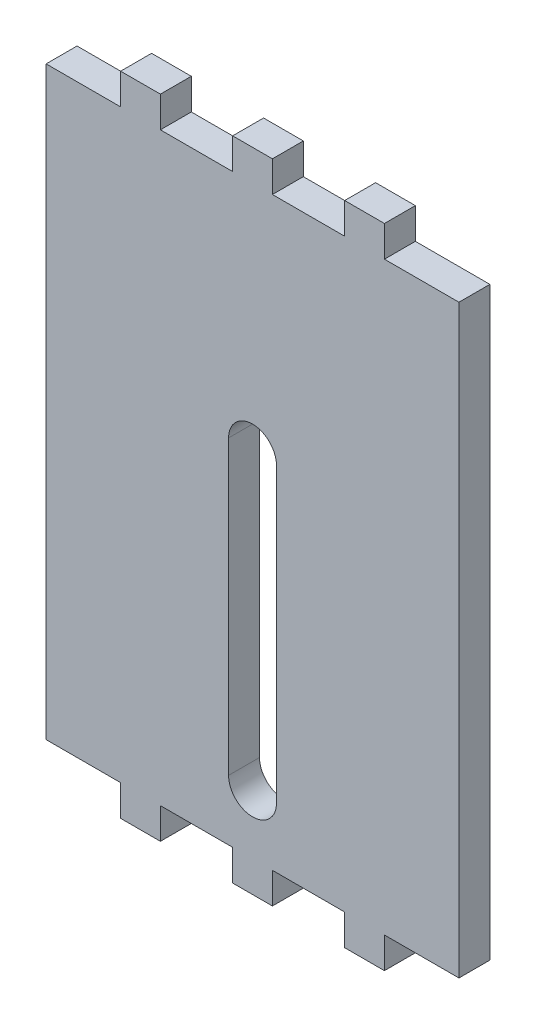
ISO-10303-21;
HEADER;
FILE_DESCRIPTION(('STEP AP214'),'2;1');
FILE_NAME('part.step','',(''),(''),'','','');
FILE_SCHEMA(('AUTOMOTIVE_DESIGN { 1 0 10303 214 1 1 1 1 }'));
ENDSEC;
DATA;
#1=APPLICATION_CONTEXT('core data for automotive mechanical design processes');
#2=APPLICATION_PROTOCOL_DEFINITION('international standard','automotive_design',2000,#1);
#3=PRODUCT_CONTEXT('',#1,'mechanical');
#4=PRODUCT('Part','Part','',(#3));
#5=PRODUCT_RELATED_PRODUCT_CATEGORY('part','',(#4));
#6=PRODUCT_DEFINITION_FORMATION('','',#4);
#7=PRODUCT_DEFINITION_CONTEXT('part definition',#1,'design');
#8=PRODUCT_DEFINITION('design','',#6,#7);
#9=PRODUCT_DEFINITION_SHAPE('','',#8);
#10=(LENGTH_UNIT() NAMED_UNIT(*) SI_UNIT(.MILLI.,.METRE.));
#11=(NAMED_UNIT(*) PLANE_ANGLE_UNIT() SI_UNIT($,.RADIAN.));
#12=(NAMED_UNIT(*) SI_UNIT($,.STERADIAN.) SOLID_ANGLE_UNIT());
#13=UNCERTAINTY_MEASURE_WITH_UNIT(LENGTH_MEASURE(1.E-05),#10,'distance_accuracy_value','');
#14=(GEOMETRIC_REPRESENTATION_CONTEXT(3) GLOBAL_UNCERTAINTY_ASSIGNED_CONTEXT((#13)) GLOBAL_UNIT_ASSIGNED_CONTEXT((#10,
#11,#12)) REPRESENTATION_CONTEXT('',''));
#15=CARTESIAN_POINT('',(0.,0.,0.));
#16=DIRECTION('',(0.,0.,1.));
#17=DIRECTION('',(1.,0.,0.));
#18=AXIS2_PLACEMENT_3D('',#15,#16,#17);
#19=CARTESIAN_POINT('',(13.54064,-21.19064,0.));
#20=DIRECTION('',(0.,-1.,0.));
#21=DIRECTION('',(0.,0.,-1.));
#22=AXIS2_PLACEMENT_3D('',#19,#20,#21);
#23=PLANE('',#22);
#24=DIRECTION('',(1.,0.,0.));
#25=VECTOR('',#24,1.);
#26=CARTESIAN_POINT('',(13.54064,-21.19064,3.175));
#27=LINE('',#26,#25);
#28=CARTESIAN_POINT('',(13.54064,-21.19064,3.175));
#29=VERTEX_POINT('',#28);
#30=CARTESIAN_POINT('',(21.19064,-21.19064,3.175));
#31=VERTEX_POINT('',#30);
#32=EDGE_CURVE('E294',#29,#31,#27,.T.);
#33=ORIENTED_EDGE('',*,*,#32,.F.);
#34=DIRECTION('',(0.,0.,1.));
#35=VECTOR('',#34,1.);
#36=CARTESIAN_POINT('',(13.54064,-21.19064,0.));
#37=LINE('',#36,#35);
#38=CARTESIAN_POINT('',(13.54064,-21.19064,0.));
#39=VERTEX_POINT('',#38);
#40=EDGE_CURVE('E11',#39,#29,#37,.T.);
#41=ORIENTED_EDGE('',*,*,#40,.F.);
#42=DIRECTION('',(1.,0.,0.));
#43=VECTOR('',#42,1.);
#44=CARTESIAN_POINT('',(13.54064,-21.19064,0.));
#45=LINE('',#44,#43);
#46=CARTESIAN_POINT('',(21.19064,-21.19064,0.));
#47=VERTEX_POINT('',#46);
#48=EDGE_CURVE('E300',#39,#47,#45,.T.);
#49=ORIENTED_EDGE('',*,*,#48,.T.);
#50=DIRECTION('',(0.,0.,1.));
#51=VECTOR('',#50,1.);
#52=CARTESIAN_POINT('',(21.19064,-21.19064,0.));
#53=LINE('',#52,#51);
#54=EDGE_CURVE('E45',#47,#31,#53,.T.);
#55=ORIENTED_EDGE('',*,*,#54,.T.);
#56=EDGE_LOOP('',(#33,#41,#49,#55));
#57=FACE_BOUND('',#56,.T.);
#58=ADVANCED_FACE('F41',(#57),#23,.T.);
#59=CARTESIAN_POINT('',(13.54064,-24.36564,0.));
#60=DIRECTION('',(1.,0.,0.));
#61=DIRECTION('',(0.,0.,-1.));
#62=AXIS2_PLACEMENT_3D('',#59,#60,#61);
#63=PLANE('',#62);
#64=DIRECTION('',(0.,1.,0.));
#65=VECTOR('',#64,1.);
#66=CARTESIAN_POINT('',(13.54064,-24.36564,3.175));
#67=LINE('',#66,#65);
#68=CARTESIAN_POINT('',(13.54064,-24.36564,3.175));
#69=VERTEX_POINT('',#68);
#70=EDGE_CURVE('E305',#69,#29,#67,.T.);
#71=ORIENTED_EDGE('',*,*,#70,.F.);
#72=DIRECTION('',(0.,0.,1.));
#73=VECTOR('',#72,1.);
#74=CARTESIAN_POINT('',(13.54064,-24.36564,0.));
#75=LINE('',#74,#73);
#76=CARTESIAN_POINT('',(13.54064,-24.36564,0.));
#77=VERTEX_POINT('',#76);
#78=EDGE_CURVE('E51',#77,#69,#75,.T.);
#79=ORIENTED_EDGE('',*,*,#78,.F.);
#80=DIRECTION('',(0.,1.,0.));
#81=VECTOR('',#80,1.);
#82=CARTESIAN_POINT('',(13.54064,-24.36564,0.));
#83=LINE('',#82,#81);
#84=EDGE_CURVE('E409',#77,#39,#83,.T.);
#85=ORIENTED_EDGE('',*,*,#84,.T.);
#86=ORIENTED_EDGE('',*,*,#40,.T.);
#87=EDGE_LOOP('',(#71,#79,#85,#86));
#88=FACE_BOUND('',#87,.T.);
#89=ADVANCED_FACE('F612',(#88),#63,.T.);
#90=CARTESIAN_POINT('',(9.45935999999996,-24.36564,0.));
#91=DIRECTION('',(0.,-1.,0.));
#92=DIRECTION('',(0.,0.,-1.));
#93=AXIS2_PLACEMENT_3D('',#90,#91,#92);
#94=PLANE('',#93);
#95=DIRECTION('',(1.,0.,0.));
#96=VECTOR('',#95,1.);
#97=CARTESIAN_POINT('',(9.45935999999996,-24.36564,3.175));
#98=LINE('',#97,#96);
#99=CARTESIAN_POINT('',(9.45935999999996,-24.36564,3.175));
#100=VERTEX_POINT('',#99);
#101=EDGE_CURVE('E516',#100,#69,#98,.T.);
#102=ORIENTED_EDGE('',*,*,#101,.F.);
#103=DIRECTION('',(0.,0.,1.));
#104=VECTOR('',#103,1.);
#105=CARTESIAN_POINT('',(9.45935999999996,-24.36564,0.));
#106=LINE('',#105,#104);
#107=CARTESIAN_POINT('',(9.45935999999996,-24.36564,0.));
#108=VERTEX_POINT('',#107);
#109=EDGE_CURVE('E525',#108,#100,#106,.T.);
#110=ORIENTED_EDGE('',*,*,#109,.F.);
#111=DIRECTION('',(1.,0.,0.));
#112=VECTOR('',#111,1.);
#113=CARTESIAN_POINT('',(9.45935999999996,-24.36564,0.));
#114=LINE('',#113,#112);
#115=EDGE_CURVE('E405',#108,#77,#114,.T.);
#116=ORIENTED_EDGE('',*,*,#115,.T.);
#117=ORIENTED_EDGE('',*,*,#78,.T.);
#118=EDGE_LOOP('',(#102,#110,#116,#117));
#119=FACE_BOUND('',#118,.T.);
#120=ADVANCED_FACE('F711',(#119),#94,.T.);
#121=CARTESIAN_POINT('',(9.45935999999996,-21.19064,0.));
#122=DIRECTION('',(-1.,0.,0.));
#123=DIRECTION('',(0.,0.,1.));
#124=AXIS2_PLACEMENT_3D('',#121,#122,#123);
#125=PLANE('',#124);
#126=DIRECTION('',(0.,-1.,0.));
#127=VECTOR('',#126,1.);
#128=CARTESIAN_POINT('',(9.45935999999996,-21.19064,3.175));
#129=LINE('',#128,#127);
#130=CARTESIAN_POINT('',(9.45935999999996,-21.19064,3.175));
#131=VERTEX_POINT('',#130);
#132=EDGE_CURVE('E512',#131,#100,#129,.T.);
#133=ORIENTED_EDGE('',*,*,#132,.F.);
#134=DIRECTION('',(0.,0.,1.));
#135=VECTOR('',#134,1.);
#136=CARTESIAN_POINT('',(9.45935999999996,-21.19064,0.));
#137=LINE('',#136,#135);
#138=CARTESIAN_POINT('',(9.45935999999996,-21.19064,0.));
#139=VERTEX_POINT('',#138);
#140=EDGE_CURVE('E528',#139,#131,#137,.T.);
#141=ORIENTED_EDGE('',*,*,#140,.F.);
#142=DIRECTION('',(0.,-1.,0.));
#143=VECTOR('',#142,1.);
#144=CARTESIAN_POINT('',(9.45935999999996,-21.19064,0.));
#145=LINE('',#144,#143);
#146=EDGE_CURVE('E401',#139,#108,#145,.T.);
#147=ORIENTED_EDGE('',*,*,#146,.T.);
#148=ORIENTED_EDGE('',*,*,#109,.T.);
#149=EDGE_LOOP('',(#133,#141,#147,#148));
#150=FACE_BOUND('',#149,.T.);
#151=ADVANCED_FACE('F709',(#150),#125,.T.);
#152=CARTESIAN_POINT('',(2.04063999999996,-21.19064,0.));
#153=DIRECTION('',(0.,-1.,0.));
#154=DIRECTION('',(0.,0.,-1.));
#155=AXIS2_PLACEMENT_3D('',#152,#153,#154);
#156=PLANE('',#155);
#157=DIRECTION('',(1.,0.,0.));
#158=VECTOR('',#157,1.);
#159=CARTESIAN_POINT('',(2.04063999999996,-21.19064,3.175));
#160=LINE('',#159,#158);
#161=CARTESIAN_POINT('',(2.04063999999996,-21.19064,3.175));
#162=VERTEX_POINT('',#161);
#163=EDGE_CURVE('E508',#162,#131,#160,.T.);
#164=ORIENTED_EDGE('',*,*,#163,.F.);
#165=DIRECTION('',(0.,0.,1.));
#166=VECTOR('',#165,1.);
#167=CARTESIAN_POINT('',(2.04063999999996,-21.19064,0.));
#168=LINE('',#167,#166);
#169=CARTESIAN_POINT('',(2.04063999999996,-21.19064,0.));
#170=VERTEX_POINT('',#169);
#171=EDGE_CURVE('E531',#170,#162,#168,.T.);
#172=ORIENTED_EDGE('',*,*,#171,.F.);
#173=DIRECTION('',(1.,0.,0.));
#174=VECTOR('',#173,1.);
#175=CARTESIAN_POINT('',(2.04063999999996,-21.19064,0.));
#176=LINE('',#175,#174);
#177=EDGE_CURVE('E397',#170,#139,#176,.T.);
#178=ORIENTED_EDGE('',*,*,#177,.T.);
#179=ORIENTED_EDGE('',*,*,#140,.T.);
#180=EDGE_LOOP('',(#164,#172,#178,#179));
#181=FACE_BOUND('',#180,.T.);
#182=ADVANCED_FACE('F705',(#181),#156,.T.);
#183=CARTESIAN_POINT('',(2.04063999999996,-24.36564,0.));
#184=DIRECTION('',(1.,0.,0.));
#185=DIRECTION('',(0.,1.,0.));
#186=AXIS2_PLACEMENT_3D('',#183,#184,#185);
#187=PLANE('',#186);
#188=DIRECTION('',(0.,1.,0.));
#189=VECTOR('',#188,1.);
#190=CARTESIAN_POINT('',(2.04063999999996,-24.36564,3.175));
#191=LINE('',#190,#189);
#192=CARTESIAN_POINT('',(2.04063999999996,-24.36564,3.175));
#193=VERTEX_POINT('',#192);
#194=EDGE_CURVE('E504',#193,#162,#191,.T.);
#195=ORIENTED_EDGE('',*,*,#194,.F.);
#196=DIRECTION('',(0.,0.,1.));
#197=VECTOR('',#196,1.);
#198=CARTESIAN_POINT('',(2.04063999999996,-24.36564,0.));
#199=LINE('',#198,#197);
#200=CARTESIAN_POINT('',(2.04063999999996,-24.36564,0.));
#201=VERTEX_POINT('',#200);
#202=EDGE_CURVE('E534',#201,#193,#199,.T.);
#203=ORIENTED_EDGE('',*,*,#202,.F.);
#204=DIRECTION('',(0.,1.,0.));
#205=VECTOR('',#204,1.);
#206=CARTESIAN_POINT('',(2.04063999999996,-24.36564,0.));
#207=LINE('',#206,#205);
#208=EDGE_CURVE('E393',#201,#170,#207,.T.);
#209=ORIENTED_EDGE('',*,*,#208,.T.);
#210=ORIENTED_EDGE('',*,*,#171,.T.);
#211=EDGE_LOOP('',(#195,#203,#209,#210));
#212=FACE_BOUND('',#211,.T.);
#213=ADVANCED_FACE('F701',(#212),#187,.T.);
#214=CARTESIAN_POINT('',(-2.04064000000004,-24.36564,0.));
#215=DIRECTION('',(0.,-1.,0.));
#216=DIRECTION('',(0.,0.,-1.));
#217=AXIS2_PLACEMENT_3D('',#214,#215,#216);
#218=PLANE('',#217);
#219=DIRECTION('',(1.,0.,0.));
#220=VECTOR('',#219,1.);
#221=CARTESIAN_POINT('',(-2.04064000000004,-24.36564,3.175));
#222=LINE('',#221,#220);
#223=CARTESIAN_POINT('',(-2.04064000000004,-24.36564,3.175));
#224=VERTEX_POINT('',#223);
#225=EDGE_CURVE('E500',#224,#193,#222,.T.);
#226=ORIENTED_EDGE('',*,*,#225,.F.);
#227=DIRECTION('',(0.,0.,1.));
#228=VECTOR('',#227,1.);
#229=CARTESIAN_POINT('',(-2.04064000000004,-24.36564,0.));
#230=LINE('',#229,#228);
#231=CARTESIAN_POINT('',(-2.04064000000004,-24.36564,0.));
#232=VERTEX_POINT('',#231);
#233=EDGE_CURVE('E537',#232,#224,#230,.T.);
#234=ORIENTED_EDGE('',*,*,#233,.F.);
#235=DIRECTION('',(1.,0.,0.));
#236=VECTOR('',#235,1.);
#237=CARTESIAN_POINT('',(-2.04064000000004,-24.36564,0.));
#238=LINE('',#237,#236);
#239=EDGE_CURVE('E389',#232,#201,#238,.T.);
#240=ORIENTED_EDGE('',*,*,#239,.T.);
#241=ORIENTED_EDGE('',*,*,#202,.T.);
#242=EDGE_LOOP('',(#226,#234,#240,#241));
#243=FACE_BOUND('',#242,.T.);
#244=ADVANCED_FACE('F697',(#243),#218,.T.);
#245=CARTESIAN_POINT('',(-2.04064000000004,-21.19064,0.));
#246=DIRECTION('',(-1.,0.,0.));
#247=DIRECTION('',(0.,-1.,0.));
#248=AXIS2_PLACEMENT_3D('',#245,#246,#247);
#249=PLANE('',#248);
#250=DIRECTION('',(0.,-1.,0.));
#251=VECTOR('',#250,1.);
#252=CARTESIAN_POINT('',(-2.04064000000004,-21.19064,3.175));
#253=LINE('',#252,#251);
#254=CARTESIAN_POINT('',(-2.04064000000004,-21.19064,3.175));
#255=VERTEX_POINT('',#254);
#256=EDGE_CURVE('E496',#255,#224,#253,.T.);
#257=ORIENTED_EDGE('',*,*,#256,.F.);
#258=DIRECTION('',(0.,0.,1.));
#259=VECTOR('',#258,1.);
#260=CARTESIAN_POINT('',(-2.04064000000004,-21.19064,0.));
#261=LINE('',#260,#259);
#262=CARTESIAN_POINT('',(-2.04064000000004,-21.19064,0.));
#263=VERTEX_POINT('',#262);
#264=EDGE_CURVE('E540',#263,#255,#261,.T.);
#265=ORIENTED_EDGE('',*,*,#264,.F.);
#266=DIRECTION('',(0.,-1.,0.));
#267=VECTOR('',#266,1.);
#268=CARTESIAN_POINT('',(-2.04064000000004,-21.19064,0.));
#269=LINE('',#268,#267);
#270=EDGE_CURVE('E385',#263,#232,#269,.T.);
#271=ORIENTED_EDGE('',*,*,#270,.T.);
#272=ORIENTED_EDGE('',*,*,#233,.T.);
#273=EDGE_LOOP('',(#257,#265,#271,#272));
#274=FACE_BOUND('',#273,.T.);
#275=ADVANCED_FACE('F693',(#274),#249,.T.);
#276=CARTESIAN_POINT('',(-9.45936000000003,-21.19064,0.));
#277=DIRECTION('',(0.,-1.,0.));
#278=DIRECTION('',(0.,0.,-1.));
#279=AXIS2_PLACEMENT_3D('',#276,#277,#278);
#280=PLANE('',#279);
#281=DIRECTION('',(1.,0.,0.));
#282=VECTOR('',#281,1.);
#283=CARTESIAN_POINT('',(-9.45936000000003,-21.19064,3.175));
#284=LINE('',#283,#282);
#285=CARTESIAN_POINT('',(-9.45936000000003,-21.19064,3.175));
#286=VERTEX_POINT('',#285);
#287=EDGE_CURVE('E492',#286,#255,#284,.T.);
#288=ORIENTED_EDGE('',*,*,#287,.F.);
#289=DIRECTION('',(0.,0.,1.));
#290=VECTOR('',#289,1.);
#291=CARTESIAN_POINT('',(-9.45936000000003,-21.19064,0.));
#292=LINE('',#291,#290);
#293=CARTESIAN_POINT('',(-9.45936000000003,-21.19064,0.));
#294=VERTEX_POINT('',#293);
#295=EDGE_CURVE('E543',#294,#286,#292,.T.);
#296=ORIENTED_EDGE('',*,*,#295,.F.);
#297=DIRECTION('',(1.,0.,0.));
#298=VECTOR('',#297,1.);
#299=CARTESIAN_POINT('',(-9.45936000000003,-21.19064,0.));
#300=LINE('',#299,#298);
#301=EDGE_CURVE('E381',#294,#263,#300,.T.);
#302=ORIENTED_EDGE('',*,*,#301,.T.);
#303=ORIENTED_EDGE('',*,*,#264,.T.);
#304=EDGE_LOOP('',(#288,#296,#302,#303));
#305=FACE_BOUND('',#304,.T.);
#306=ADVANCED_FACE('F689',(#305),#280,.T.);
#307=CARTESIAN_POINT('',(-9.45936000000003,-24.36564,0.));
#308=DIRECTION('',(1.,0.,0.));
#309=DIRECTION('',(0.,0.,-1.));
#310=AXIS2_PLACEMENT_3D('',#307,#308,#309);
#311=PLANE('',#310);
#312=DIRECTION('',(0.,1.,0.));
#313=VECTOR('',#312,1.);
#314=CARTESIAN_POINT('',(-9.45936000000003,-24.36564,3.175));
#315=LINE('',#314,#313);
#316=CARTESIAN_POINT('',(-9.45936000000003,-24.36564,3.175));
#317=VERTEX_POINT('',#316);
#318=EDGE_CURVE('E488',#317,#286,#315,.T.);
#319=ORIENTED_EDGE('',*,*,#318,.F.);
#320=DIRECTION('',(0.,0.,1.));
#321=VECTOR('',#320,1.);
#322=CARTESIAN_POINT('',(-9.45936000000003,-24.36564,0.));
#323=LINE('',#322,#321);
#324=CARTESIAN_POINT('',(-9.45936000000003,-24.36564,0.));
#325=VERTEX_POINT('',#324);
#326=EDGE_CURVE('E546',#325,#317,#323,.T.);
#327=ORIENTED_EDGE('',*,*,#326,.F.);
#328=DIRECTION('',(0.,1.,0.));
#329=VECTOR('',#328,1.);
#330=CARTESIAN_POINT('',(-9.45936000000003,-24.36564,0.));
#331=LINE('',#330,#329);
#332=EDGE_CURVE('E377',#325,#294,#331,.T.);
#333=ORIENTED_EDGE('',*,*,#332,.T.);
#334=ORIENTED_EDGE('',*,*,#295,.T.);
#335=EDGE_LOOP('',(#319,#327,#333,#334));
#336=FACE_BOUND('',#335,.T.);
#337=ADVANCED_FACE('F685',(#336),#311,.T.);
#338=CARTESIAN_POINT('',(-13.54064,-24.36564,0.));
#339=DIRECTION('',(0.,-1.,0.));
#340=DIRECTION('',(0.,0.,-1.));
#341=AXIS2_PLACEMENT_3D('',#338,#339,#340);
#342=PLANE('',#341);
#343=DIRECTION('',(1.,0.,0.));
#344=VECTOR('',#343,1.);
#345=CARTESIAN_POINT('',(-13.54064,-24.36564,3.175));
#346=LINE('',#345,#344);
#347=CARTESIAN_POINT('',(-13.54064,-24.36564,3.175));
#348=VERTEX_POINT('',#347);
#349=EDGE_CURVE('E484',#348,#317,#346,.T.);
#350=ORIENTED_EDGE('',*,*,#349,.F.);
#351=DIRECTION('',(0.,0.,1.));
#352=VECTOR('',#351,1.);
#353=CARTESIAN_POINT('',(-13.54064,-24.36564,0.));
#354=LINE('',#353,#352);
#355=CARTESIAN_POINT('',(-13.54064,-24.36564,0.));
#356=VERTEX_POINT('',#355);
#357=EDGE_CURVE('E549',#356,#348,#354,.T.);
#358=ORIENTED_EDGE('',*,*,#357,.F.);
#359=DIRECTION('',(1.,0.,0.));
#360=VECTOR('',#359,1.);
#361=CARTESIAN_POINT('',(-13.54064,-24.36564,0.));
#362=LINE('',#361,#360);
#363=EDGE_CURVE('E373',#356,#325,#362,.T.);
#364=ORIENTED_EDGE('',*,*,#363,.T.);
#365=ORIENTED_EDGE('',*,*,#326,.T.);
#366=EDGE_LOOP('',(#350,#358,#364,#365));
#367=FACE_BOUND('',#366,.T.);
#368=ADVANCED_FACE('F681',(#367),#342,.T.);
#369=CARTESIAN_POINT('',(-13.54064,-21.19064,0.));
#370=DIRECTION('',(-1.,0.,0.));
#371=DIRECTION('',(0.,-1.,0.));
#372=AXIS2_PLACEMENT_3D('',#369,#370,#371);
#373=PLANE('',#372);
#374=DIRECTION('',(0.,-1.,0.));
#375=VECTOR('',#374,1.);
#376=CARTESIAN_POINT('',(-13.54064,-21.19064,3.175));
#377=LINE('',#376,#375);
#378=CARTESIAN_POINT('',(-13.54064,-21.19064,3.175));
#379=VERTEX_POINT('',#378);
#380=EDGE_CURVE('E480',#379,#348,#377,.T.);
#381=ORIENTED_EDGE('',*,*,#380,.F.);
#382=DIRECTION('',(0.,0.,1.));
#383=VECTOR('',#382,1.);
#384=CARTESIAN_POINT('',(-13.54064,-21.19064,0.));
#385=LINE('',#384,#383);
#386=CARTESIAN_POINT('',(-13.54064,-21.19064,0.));
#387=VERTEX_POINT('',#386);
#388=EDGE_CURVE('E552',#387,#379,#385,.T.);
#389=ORIENTED_EDGE('',*,*,#388,.F.);
#390=DIRECTION('',(0.,-1.,0.));
#391=VECTOR('',#390,1.);
#392=CARTESIAN_POINT('',(-13.54064,-21.19064,0.));
#393=LINE('',#392,#391);
#394=EDGE_CURVE('E369',#387,#356,#393,.T.);
#395=ORIENTED_EDGE('',*,*,#394,.T.);
#396=ORIENTED_EDGE('',*,*,#357,.T.);
#397=EDGE_LOOP('',(#381,#389,#395,#396));
#398=FACE_BOUND('',#397,.T.);
#399=ADVANCED_FACE('F677',(#398),#373,.T.);
#400=CARTESIAN_POINT('',(-21.19064,-21.19064,0.));
#401=DIRECTION('',(0.,-1.,0.));
#402=DIRECTION('',(0.,0.,-1.));
#403=AXIS2_PLACEMENT_3D('',#400,#401,#402);
#404=PLANE('',#403);
#405=DIRECTION('',(1.,0.,0.));
#406=VECTOR('',#405,1.);
#407=CARTESIAN_POINT('',(-21.19064,-21.19064,3.175));
#408=LINE('',#407,#406);
#409=CARTESIAN_POINT('',(-21.19064,-21.19064,3.175));
#410=VERTEX_POINT('',#409);
#411=EDGE_CURVE('E476',#410,#379,#408,.T.);
#412=ORIENTED_EDGE('',*,*,#411,.F.);
#413=DIRECTION('',(0.,0.,1.));
#414=VECTOR('',#413,1.);
#415=CARTESIAN_POINT('',(-21.19064,-21.19064,0.));
#416=LINE('',#415,#414);
#417=CARTESIAN_POINT('',(-21.19064,-21.19064,0.));
#418=VERTEX_POINT('',#417);
#419=EDGE_CURVE('E555',#418,#410,#416,.T.);
#420=ORIENTED_EDGE('',*,*,#419,.F.);
#421=DIRECTION('',(1.,0.,0.));
#422=VECTOR('',#421,1.);
#423=CARTESIAN_POINT('',(-21.19064,-21.19064,0.));
#424=LINE('',#423,#422);
#425=EDGE_CURVE('E365',#418,#387,#424,.T.);
#426=ORIENTED_EDGE('',*,*,#425,.T.);
#427=ORIENTED_EDGE('',*,*,#388,.T.);
#428=EDGE_LOOP('',(#412,#420,#426,#427));
#429=FACE_BOUND('',#428,.T.);
#430=ADVANCED_FACE('F673',(#429),#404,.T.);
#431=CARTESIAN_POINT('',(-21.19064,38.89064,0.));
#432=DIRECTION('',(-1.,0.,0.));
#433=DIRECTION('',(0.,-1.,0.));
#434=AXIS2_PLACEMENT_3D('',#431,#432,#433);
#435=PLANE('',#434);
#436=DIRECTION('',(0.,-1.,0.));
#437=VECTOR('',#436,1.);
#438=CARTESIAN_POINT('',(-21.19064,38.89064,3.175));
#439=LINE('',#438,#437);
#440=CARTESIAN_POINT('',(-21.19064,38.89064,3.175));
#441=VERTEX_POINT('',#440);
#442=EDGE_CURVE('E472',#441,#410,#439,.T.);
#443=ORIENTED_EDGE('',*,*,#442,.F.);
#444=DIRECTION('',(0.,0.,1.));
#445=VECTOR('',#444,1.);
#446=CARTESIAN_POINT('',(-21.19064,38.89064,0.));
#447=LINE('',#446,#445);
#448=CARTESIAN_POINT('',(-21.19064,38.89064,0.));
#449=VERTEX_POINT('',#448);
#450=EDGE_CURVE('E558',#449,#441,#447,.T.);
#451=ORIENTED_EDGE('',*,*,#450,.F.);
#452=DIRECTION('',(0.,-1.,0.));
#453=VECTOR('',#452,1.);
#454=CARTESIAN_POINT('',(-21.19064,38.89064,0.));
#455=LINE('',#454,#453);
#456=EDGE_CURVE('E361',#449,#418,#455,.T.);
#457=ORIENTED_EDGE('',*,*,#456,.T.);
#458=ORIENTED_EDGE('',*,*,#419,.T.);
#459=EDGE_LOOP('',(#443,#451,#457,#458));
#460=FACE_BOUND('',#459,.T.);
#461=ADVANCED_FACE('F669',(#460),#435,.T.);
#462=CARTESIAN_POINT('',(-13.5406400000001,38.89064,0.));
#463=DIRECTION('',(0.,1.,0.));
#464=DIRECTION('',(0.,0.,1.));
#465=AXIS2_PLACEMENT_3D('',#462,#463,#464);
#466=PLANE('',#465);
#467=DIRECTION('',(-1.,0.,0.));
#468=VECTOR('',#467,1.);
#469=CARTESIAN_POINT('',(-13.5406400000001,38.89064,3.175));
#470=LINE('',#469,#468);
#471=CARTESIAN_POINT('',(-13.5406400000001,38.89064,3.175));
#472=VERTEX_POINT('',#471);
#473=EDGE_CURVE('E468',#472,#441,#470,.T.);
#474=ORIENTED_EDGE('',*,*,#473,.F.);
#475=DIRECTION('',(0.,0.,1.));
#476=VECTOR('',#475,1.);
#477=CARTESIAN_POINT('',(-13.5406400000001,38.89064,0.));
#478=LINE('',#477,#476);
#479=CARTESIAN_POINT('',(-13.5406400000001,38.89064,0.));
#480=VERTEX_POINT('',#479);
#481=EDGE_CURVE('E561',#480,#472,#478,.T.);
#482=ORIENTED_EDGE('',*,*,#481,.F.);
#483=DIRECTION('',(-1.,0.,0.));
#484=VECTOR('',#483,1.);
#485=CARTESIAN_POINT('',(-13.5406400000001,38.89064,0.));
#486=LINE('',#485,#484);
#487=EDGE_CURVE('E357',#480,#449,#486,.T.);
#488=ORIENTED_EDGE('',*,*,#487,.T.);
#489=ORIENTED_EDGE('',*,*,#450,.T.);
#490=EDGE_LOOP('',(#474,#482,#488,#489));
#491=FACE_BOUND('',#490,.T.);
#492=ADVANCED_FACE('F665',(#491),#466,.T.);
#493=CARTESIAN_POINT('',(-13.5406400000001,42.06564,0.));
#494=DIRECTION('',(-1.,0.,0.));
#495=DIRECTION('',(0.,-1.,0.));
#496=AXIS2_PLACEMENT_3D('',#493,#494,#495);
#497=PLANE('',#496);
#498=DIRECTION('',(0.,-1.,0.));
#499=VECTOR('',#498,1.);
#500=CARTESIAN_POINT('',(-13.5406400000001,42.06564,3.175));
#501=LINE('',#500,#499);
#502=CARTESIAN_POINT('',(-13.5406400000001,42.06564,3.175));
#503=VERTEX_POINT('',#502);
#504=EDGE_CURVE('E464',#503,#472,#501,.T.);
#505=ORIENTED_EDGE('',*,*,#504,.F.);
#506=DIRECTION('',(0.,0.,1.));
#507=VECTOR('',#506,1.);
#508=CARTESIAN_POINT('',(-13.5406400000001,42.06564,0.));
#509=LINE('',#508,#507);
#510=CARTESIAN_POINT('',(-13.5406400000001,42.06564,0.));
#511=VERTEX_POINT('',#510);
#512=EDGE_CURVE('E564',#511,#503,#509,.T.);
#513=ORIENTED_EDGE('',*,*,#512,.F.);
#514=DIRECTION('',(0.,-1.,0.));
#515=VECTOR('',#514,1.);
#516=CARTESIAN_POINT('',(-13.5406400000001,42.06564,0.));
#517=LINE('',#516,#515);
#518=EDGE_CURVE('E353',#511,#480,#517,.T.);
#519=ORIENTED_EDGE('',*,*,#518,.T.);
#520=ORIENTED_EDGE('',*,*,#481,.T.);
#521=EDGE_LOOP('',(#505,#513,#519,#520));
#522=FACE_BOUND('',#521,.T.);
#523=ADVANCED_FACE('F661',(#522),#497,.T.);
#524=CARTESIAN_POINT('',(-9.45936000000003,42.06564,0.));
#525=DIRECTION('',(0.,1.,0.));
#526=DIRECTION('',(-1.,0.,0.));
#527=AXIS2_PLACEMENT_3D('',#524,#525,#526);
#528=PLANE('',#527);
#529=DIRECTION('',(-1.,0.,0.));
#530=VECTOR('',#529,1.);
#531=CARTESIAN_POINT('',(-9.45936000000003,42.06564,3.175));
#532=LINE('',#531,#530);
#533=CARTESIAN_POINT('',(-9.45936000000003,42.06564,3.175));
#534=VERTEX_POINT('',#533);
#535=EDGE_CURVE('E460',#534,#503,#532,.T.);
#536=ORIENTED_EDGE('',*,*,#535,.F.);
#537=DIRECTION('',(0.,0.,1.));
#538=VECTOR('',#537,1.);
#539=CARTESIAN_POINT('',(-9.45936000000003,42.06564,0.));
#540=LINE('',#539,#538);
#541=CARTESIAN_POINT('',(-9.45936000000003,42.06564,0.));
#542=VERTEX_POINT('',#541);
#543=EDGE_CURVE('E567',#542,#534,#540,.T.);
#544=ORIENTED_EDGE('',*,*,#543,.F.);
#545=DIRECTION('',(-1.,0.,0.));
#546=VECTOR('',#545,1.);
#547=CARTESIAN_POINT('',(-9.45936000000003,42.06564,0.));
#548=LINE('',#547,#546);
#549=EDGE_CURVE('E349',#542,#511,#548,.T.);
#550=ORIENTED_EDGE('',*,*,#549,.T.);
#551=ORIENTED_EDGE('',*,*,#512,.T.);
#552=EDGE_LOOP('',(#536,#544,#550,#551));
#553=FACE_BOUND('',#552,.T.);
#554=ADVANCED_FACE('F657',(#553),#528,.T.);
#555=CARTESIAN_POINT('',(-9.45936000000003,38.89064,0.));
#556=DIRECTION('',(1.,0.,0.));
#557=DIRECTION('',(0.,0.,-1.));
#558=AXIS2_PLACEMENT_3D('',#555,#556,#557);
#559=PLANE('',#558);
#560=DIRECTION('',(0.,1.,0.));
#561=VECTOR('',#560,1.);
#562=CARTESIAN_POINT('',(-9.45936000000003,38.89064,3.175));
#563=LINE('',#562,#561);
#564=CARTESIAN_POINT('',(-9.45936000000003,38.89064,3.175));
#565=VERTEX_POINT('',#564);
#566=EDGE_CURVE('E456',#565,#534,#563,.T.);
#567=ORIENTED_EDGE('',*,*,#566,.F.);
#568=DIRECTION('',(0.,0.,1.));
#569=VECTOR('',#568,1.);
#570=CARTESIAN_POINT('',(-9.45936000000003,38.89064,0.));
#571=LINE('',#570,#569);
#572=CARTESIAN_POINT('',(-9.45936000000003,38.89064,0.));
#573=VERTEX_POINT('',#572);
#574=EDGE_CURVE('E570',#573,#565,#571,.T.);
#575=ORIENTED_EDGE('',*,*,#574,.F.);
#576=DIRECTION('',(0.,1.,0.));
#577=VECTOR('',#576,1.);
#578=CARTESIAN_POINT('',(-9.45936000000003,38.89064,0.));
#579=LINE('',#578,#577);
#580=EDGE_CURVE('E345',#573,#542,#579,.T.);
#581=ORIENTED_EDGE('',*,*,#580,.T.);
#582=ORIENTED_EDGE('',*,*,#543,.T.);
#583=EDGE_LOOP('',(#567,#575,#581,#582));
#584=FACE_BOUND('',#583,.T.);
#585=ADVANCED_FACE('F653',(#584),#559,.T.);
#586=CARTESIAN_POINT('',(-2.04064000000004,38.89064,0.));
#587=DIRECTION('',(0.,1.,0.));
#588=DIRECTION('',(0.,0.,1.));
#589=AXIS2_PLACEMENT_3D('',#586,#587,#588);
#590=PLANE('',#589);
#591=DIRECTION('',(-1.,0.,0.));
#592=VECTOR('',#591,1.);
#593=CARTESIAN_POINT('',(-2.04064000000004,38.89064,3.175));
#594=LINE('',#593,#592);
#595=CARTESIAN_POINT('',(-2.04064000000004,38.89064,3.175));
#596=VERTEX_POINT('',#595);
#597=EDGE_CURVE('E452',#596,#565,#594,.T.);
#598=ORIENTED_EDGE('',*,*,#597,.F.);
#599=DIRECTION('',(0.,0.,1.));
#600=VECTOR('',#599,1.);
#601=CARTESIAN_POINT('',(-2.04064000000004,38.89064,0.));
#602=LINE('',#601,#600);
#603=CARTESIAN_POINT('',(-2.04064000000004,38.89064,0.));
#604=VERTEX_POINT('',#603);
#605=EDGE_CURVE('E573',#604,#596,#602,.T.);
#606=ORIENTED_EDGE('',*,*,#605,.F.);
#607=DIRECTION('',(-1.,0.,0.));
#608=VECTOR('',#607,1.);
#609=CARTESIAN_POINT('',(-2.04064000000004,38.89064,0.));
#610=LINE('',#609,#608);
#611=EDGE_CURVE('E341',#604,#573,#610,.T.);
#612=ORIENTED_EDGE('',*,*,#611,.T.);
#613=ORIENTED_EDGE('',*,*,#574,.T.);
#614=EDGE_LOOP('',(#598,#606,#612,#613));
#615=FACE_BOUND('',#614,.T.);
#616=ADVANCED_FACE('F649',(#615),#590,.T.);
#617=CARTESIAN_POINT('',(-2.04064000000004,42.06564,0.));
#618=DIRECTION('',(-1.,0.,0.));
#619=DIRECTION('',(0.,-1.,0.));
#620=AXIS2_PLACEMENT_3D('',#617,#618,#619);
#621=PLANE('',#620);
#622=DIRECTION('',(0.,-1.,0.));
#623=VECTOR('',#622,1.);
#624=CARTESIAN_POINT('',(-2.04064000000004,42.06564,3.175));
#625=LINE('',#624,#623);
#626=CARTESIAN_POINT('',(-2.04064000000004,42.06564,3.175));
#627=VERTEX_POINT('',#626);
#628=EDGE_CURVE('E448',#627,#596,#625,.T.);
#629=ORIENTED_EDGE('',*,*,#628,.F.);
#630=DIRECTION('',(0.,0.,1.));
#631=VECTOR('',#630,1.);
#632=CARTESIAN_POINT('',(-2.04064000000004,42.06564,0.));
#633=LINE('',#632,#631);
#634=CARTESIAN_POINT('',(-2.04064000000004,42.06564,0.));
#635=VERTEX_POINT('',#634);
#636=EDGE_CURVE('E576',#635,#627,#633,.T.);
#637=ORIENTED_EDGE('',*,*,#636,.F.);
#638=DIRECTION('',(0.,-1.,0.));
#639=VECTOR('',#638,1.);
#640=CARTESIAN_POINT('',(-2.04064000000004,42.06564,0.));
#641=LINE('',#640,#639);
#642=EDGE_CURVE('E337',#635,#604,#641,.T.);
#643=ORIENTED_EDGE('',*,*,#642,.T.);
#644=ORIENTED_EDGE('',*,*,#605,.T.);
#645=EDGE_LOOP('',(#629,#637,#643,#644));
#646=FACE_BOUND('',#645,.T.);
#647=ADVANCED_FACE('F645',(#646),#621,.T.);
#648=CARTESIAN_POINT('',(2.04063999999996,42.06564,0.));
#649=DIRECTION('',(0.,1.,0.));
#650=DIRECTION('',(0.,0.,1.));
#651=AXIS2_PLACEMENT_3D('',#648,#649,#650);
#652=PLANE('',#651);
#653=DIRECTION('',(-1.,0.,0.));
#654=VECTOR('',#653,1.);
#655=CARTESIAN_POINT('',(2.04063999999996,42.06564,3.175));
#656=LINE('',#655,#654);
#657=CARTESIAN_POINT('',(2.04063999999996,42.06564,3.175));
#658=VERTEX_POINT('',#657);
#659=EDGE_CURVE('E444',#658,#627,#656,.T.);
#660=ORIENTED_EDGE('',*,*,#659,.F.);
#661=DIRECTION('',(0.,0.,1.));
#662=VECTOR('',#661,1.);
#663=CARTESIAN_POINT('',(2.04063999999996,42.06564,0.));
#664=LINE('',#663,#662);
#665=CARTESIAN_POINT('',(2.04063999999996,42.06564,0.));
#666=VERTEX_POINT('',#665);
#667=EDGE_CURVE('E579',#666,#658,#664,.T.);
#668=ORIENTED_EDGE('',*,*,#667,.F.);
#669=DIRECTION('',(-1.,0.,0.));
#670=VECTOR('',#669,1.);
#671=CARTESIAN_POINT('',(2.04063999999996,42.06564,0.));
#672=LINE('',#671,#670);
#673=EDGE_CURVE('E333',#666,#635,#672,.T.);
#674=ORIENTED_EDGE('',*,*,#673,.T.);
#675=ORIENTED_EDGE('',*,*,#636,.T.);
#676=EDGE_LOOP('',(#660,#668,#674,#675));
#677=FACE_BOUND('',#676,.T.);
#678=ADVANCED_FACE('F641',(#677),#652,.T.);
#679=CARTESIAN_POINT('',(2.04063999999996,38.89064,0.));
#680=DIRECTION('',(1.,0.,0.));
#681=DIRECTION('',(0.,0.,-1.));
#682=AXIS2_PLACEMENT_3D('',#679,#680,#681);
#683=PLANE('',#682);
#684=DIRECTION('',(0.,1.,0.));
#685=VECTOR('',#684,1.);
#686=CARTESIAN_POINT('',(2.04063999999996,38.89064,3.175));
#687=LINE('',#686,#685);
#688=CARTESIAN_POINT('',(2.04063999999996,38.89064,3.175));
#689=VERTEX_POINT('',#688);
#690=EDGE_CURVE('E440',#689,#658,#687,.T.);
#691=ORIENTED_EDGE('',*,*,#690,.F.);
#692=DIRECTION('',(0.,0.,1.));
#693=VECTOR('',#692,1.);
#694=CARTESIAN_POINT('',(2.04063999999996,38.89064,0.));
#695=LINE('',#694,#693);
#696=CARTESIAN_POINT('',(2.04063999999996,38.89064,0.));
#697=VERTEX_POINT('',#696);
#698=EDGE_CURVE('E582',#697,#689,#695,.T.);
#699=ORIENTED_EDGE('',*,*,#698,.F.);
#700=DIRECTION('',(0.,1.,0.));
#701=VECTOR('',#700,1.);
#702=CARTESIAN_POINT('',(2.04063999999996,38.89064,0.));
#703=LINE('',#702,#701);
#704=EDGE_CURVE('E329',#697,#666,#703,.T.);
#705=ORIENTED_EDGE('',*,*,#704,.T.);
#706=ORIENTED_EDGE('',*,*,#667,.T.);
#707=EDGE_LOOP('',(#691,#699,#705,#706));
#708=FACE_BOUND('',#707,.T.);
#709=ADVANCED_FACE('F637',(#708),#683,.T.);
#710=CARTESIAN_POINT('',(9.45935999999996,38.89064,0.));
#711=DIRECTION('',(0.,1.,0.));
#712=DIRECTION('',(0.,0.,1.));
#713=AXIS2_PLACEMENT_3D('',#710,#711,#712);
#714=PLANE('',#713);
#715=DIRECTION('',(-1.,0.,0.));
#716=VECTOR('',#715,1.);
#717=CARTESIAN_POINT('',(9.45935999999996,38.89064,3.175));
#718=LINE('',#717,#716);
#719=CARTESIAN_POINT('',(9.45935999999996,38.89064,3.175));
#720=VERTEX_POINT('',#719);
#721=EDGE_CURVE('E436',#720,#689,#718,.T.);
#722=ORIENTED_EDGE('',*,*,#721,.F.);
#723=DIRECTION('',(0.,0.,1.));
#724=VECTOR('',#723,1.);
#725=CARTESIAN_POINT('',(9.45935999999996,38.89064,0.));
#726=LINE('',#725,#724);
#727=CARTESIAN_POINT('',(9.45935999999996,38.89064,0.));
#728=VERTEX_POINT('',#727);
#729=EDGE_CURVE('E585',#728,#720,#726,.T.);
#730=ORIENTED_EDGE('',*,*,#729,.F.);
#731=DIRECTION('',(-1.,0.,0.));
#732=VECTOR('',#731,1.);
#733=CARTESIAN_POINT('',(9.45935999999996,38.89064,0.));
#734=LINE('',#733,#732);
#735=EDGE_CURVE('E325',#728,#697,#734,.T.);
#736=ORIENTED_EDGE('',*,*,#735,.T.);
#737=ORIENTED_EDGE('',*,*,#698,.T.);
#738=EDGE_LOOP('',(#722,#730,#736,#737));
#739=FACE_BOUND('',#738,.T.);
#740=ADVANCED_FACE('F633',(#739),#714,.T.);
#741=CARTESIAN_POINT('',(9.45935999999996,42.06564,0.));
#742=DIRECTION('',(-1.,0.,0.));
#743=DIRECTION('',(0.,0.,1.));
#744=AXIS2_PLACEMENT_3D('',#741,#742,#743);
#745=PLANE('',#744);
#746=DIRECTION('',(0.,-1.,0.));
#747=VECTOR('',#746,1.);
#748=CARTESIAN_POINT('',(9.45935999999996,42.06564,3.175));
#749=LINE('',#748,#747);
#750=CARTESIAN_POINT('',(9.45935999999996,42.06564,3.175));
#751=VERTEX_POINT('',#750);
#752=EDGE_CURVE('E432',#751,#720,#749,.T.);
#753=ORIENTED_EDGE('',*,*,#752,.F.);
#754=DIRECTION('',(0.,0.,1.));
#755=VECTOR('',#754,1.);
#756=CARTESIAN_POINT('',(9.45935999999996,42.06564,0.));
#757=LINE('',#756,#755);
#758=CARTESIAN_POINT('',(9.45935999999996,42.06564,0.));
#759=VERTEX_POINT('',#758);
#760=EDGE_CURVE('E588',#759,#751,#757,.T.);
#761=ORIENTED_EDGE('',*,*,#760,.F.);
#762=DIRECTION('',(0.,-1.,0.));
#763=VECTOR('',#762,1.);
#764=CARTESIAN_POINT('',(9.45935999999996,42.06564,0.));
#765=LINE('',#764,#763);
#766=EDGE_CURVE('E321',#759,#728,#765,.T.);
#767=ORIENTED_EDGE('',*,*,#766,.T.);
#768=ORIENTED_EDGE('',*,*,#729,.T.);
#769=EDGE_LOOP('',(#753,#761,#767,#768));
#770=FACE_BOUND('',#769,.T.);
#771=ADVANCED_FACE('F629',(#770),#745,.T.);
#772=CARTESIAN_POINT('',(13.54064,42.06564,0.));
#773=DIRECTION('',(0.,1.,0.));
#774=DIRECTION('',(0.,0.,1.));
#775=AXIS2_PLACEMENT_3D('',#772,#773,#774);
#776=PLANE('',#775);
#777=DIRECTION('',(-1.,0.,0.));
#778=VECTOR('',#777,1.);
#779=CARTESIAN_POINT('',(13.54064,42.06564,3.175));
#780=LINE('',#779,#778);
#781=CARTESIAN_POINT('',(13.54064,42.06564,3.175));
#782=VERTEX_POINT('',#781);
#783=EDGE_CURVE('E428',#782,#751,#780,.T.);
#784=ORIENTED_EDGE('',*,*,#783,.F.);
#785=DIRECTION('',(0.,0.,1.));
#786=VECTOR('',#785,1.);
#787=CARTESIAN_POINT('',(13.54064,42.06564,0.));
#788=LINE('',#787,#786);
#789=CARTESIAN_POINT('',(13.54064,42.06564,0.));
#790=VERTEX_POINT('',#789);
#791=EDGE_CURVE('E591',#790,#782,#788,.T.);
#792=ORIENTED_EDGE('',*,*,#791,.F.);
#793=DIRECTION('',(-1.,0.,0.));
#794=VECTOR('',#793,1.);
#795=CARTESIAN_POINT('',(13.54064,42.06564,0.));
#796=LINE('',#795,#794);
#797=EDGE_CURVE('E317',#790,#759,#796,.T.);
#798=ORIENTED_EDGE('',*,*,#797,.T.);
#799=ORIENTED_EDGE('',*,*,#760,.T.);
#800=EDGE_LOOP('',(#784,#792,#798,#799));
#801=FACE_BOUND('',#800,.T.);
#802=ADVANCED_FACE('F625',(#801),#776,.T.);
#803=CARTESIAN_POINT('',(13.54064,38.89064,0.));
#804=DIRECTION('',(1.,0.,0.));
#805=DIRECTION('',(0.,0.,-1.));
#806=AXIS2_PLACEMENT_3D('',#803,#804,#805);
#807=PLANE('',#806);
#808=DIRECTION('',(0.,1.,0.));
#809=VECTOR('',#808,1.);
#810=CARTESIAN_POINT('',(13.54064,38.89064,3.175));
#811=LINE('',#810,#809);
#812=CARTESIAN_POINT('',(13.54064,38.89064,3.175));
#813=VERTEX_POINT('',#812);
#814=EDGE_CURVE('E424',#813,#782,#811,.T.);
#815=ORIENTED_EDGE('',*,*,#814,.F.);
#816=DIRECTION('',(0.,0.,1.));
#817=VECTOR('',#816,1.);
#818=CARTESIAN_POINT('',(13.54064,38.89064,0.));
#819=LINE('',#818,#817);
#820=CARTESIAN_POINT('',(13.54064,38.89064,0.));
#821=VERTEX_POINT('',#820);
#822=EDGE_CURVE('E594',#821,#813,#819,.T.);
#823=ORIENTED_EDGE('',*,*,#822,.F.);
#824=DIRECTION('',(0.,1.,0.));
#825=VECTOR('',#824,1.);
#826=CARTESIAN_POINT('',(13.54064,38.89064,0.));
#827=LINE('',#826,#825);
#828=EDGE_CURVE('E313',#821,#790,#827,.T.);
#829=ORIENTED_EDGE('',*,*,#828,.T.);
#830=ORIENTED_EDGE('',*,*,#791,.T.);
#831=EDGE_LOOP('',(#815,#823,#829,#830));
#832=FACE_BOUND('',#831,.T.);
#833=ADVANCED_FACE('F623',(#832),#807,.T.);
#834=CARTESIAN_POINT('',(21.19064,38.89064,0.));
#835=DIRECTION('',(0.,1.,0.));
#836=DIRECTION('',(0.,0.,1.));
#837=AXIS2_PLACEMENT_3D('',#834,#835,#836);
#838=PLANE('',#837);
#839=DIRECTION('',(-1.,0.,0.));
#840=VECTOR('',#839,1.);
#841=CARTESIAN_POINT('',(21.19064,38.89064,3.175));
#842=LINE('',#841,#840);
#843=CARTESIAN_POINT('',(21.19064,38.89064,3.175));
#844=VERTEX_POINT('',#843);
#845=EDGE_CURVE('E420',#844,#813,#842,.T.);
#846=ORIENTED_EDGE('',*,*,#845,.F.);
#847=DIRECTION('',(0.,0.,1.));
#848=VECTOR('',#847,1.);
#849=CARTESIAN_POINT('',(21.19064,38.89064,0.));
#850=LINE('',#849,#848);
#851=CARTESIAN_POINT('',(21.19064,38.89064,0.));
#852=VERTEX_POINT('',#851);
#853=EDGE_CURVE('E596',#852,#844,#850,.T.);
#854=ORIENTED_EDGE('',*,*,#853,.F.);
#855=DIRECTION('',(-1.,0.,0.));
#856=VECTOR('',#855,1.);
#857=CARTESIAN_POINT('',(21.19064,38.89064,0.));
#858=LINE('',#857,#856);
#859=EDGE_CURVE('E309',#852,#821,#858,.T.);
#860=ORIENTED_EDGE('',*,*,#859,.T.);
#861=ORIENTED_EDGE('',*,*,#822,.T.);
#862=EDGE_LOOP('',(#846,#854,#860,#861));
#863=FACE_BOUND('',#862,.T.);
#864=ADVANCED_FACE('F619',(#863),#838,.T.);
#865=CARTESIAN_POINT('',(21.19064,-21.19064,0.));
#866=DIRECTION('',(1.,0.,0.));
#867=DIRECTION('',(0.,0.,-1.));
#868=AXIS2_PLACEMENT_3D('',#865,#866,#867);
#869=PLANE('',#868);
#870=DIRECTION('',(0.,1.,0.));
#871=VECTOR('',#870,1.);
#872=CARTESIAN_POINT('',(21.19064,-21.19064,3.175));
#873=LINE('',#872,#871);
#874=EDGE_CURVE('E416',#31,#844,#873,.T.);
#875=ORIENTED_EDGE('',*,*,#874,.F.);
#876=ORIENTED_EDGE('',*,*,#54,.F.);
#877=DIRECTION('',(0.,1.,0.));
#878=VECTOR('',#877,1.);
#879=CARTESIAN_POINT('',(21.19064,-21.19064,0.));
#880=LINE('',#879,#878);
#881=EDGE_CURVE('E304',#47,#852,#880,.T.);
#882=ORIENTED_EDGE('',*,*,#881,.T.);
#883=ORIENTED_EDGE('',*,*,#853,.T.);
#884=EDGE_LOOP('',(#875,#876,#882,#883));
#885=FACE_BOUND('',#884,.T.);
#886=ADVANCED_FACE('F606',(#885),#869,.T.);
#887=CARTESIAN_POINT('',(0.,0.,3.175));
#888=DIRECTION('',(0.,0.,1.));
#889=DIRECTION('',(1.,0.,0.));
#890=AXIS2_PLACEMENT_3D('',#887,#888,#889);
#891=PLANE('',#890);
#892=CARTESIAN_POINT('',(0.,-15.,3.175));
#893=DIRECTION('',(0.,0.,1.));
#894=DIRECTION('',(1.,0.,0.));
#895=AXIS2_PLACEMENT_3D('',#892,#893,#894);
#896=CIRCLE('',#895,2.45936);
#897=CARTESIAN_POINT('',(-2.45936,-15.,3.175));
#898=VERTEX_POINT('',#897);
#899=CARTESIAN_POINT('',(2.45936,-15.,3.175));
#900=VERTEX_POINT('',#899);
#901=EDGE_CURVE('E67',#898,#900,#896,.T.);
#902=ORIENTED_EDGE('',*,*,#901,.F.);
#903=DIRECTION('',(0.,-1.,0.));
#904=VECTOR('',#903,1.);
#905=CARTESIAN_POINT('',(-2.45936,15.,3.175));
#906=LINE('',#905,#904);
#907=CARTESIAN_POINT('',(-2.45936,15.,3.175));
#908=VERTEX_POINT('',#907);
#909=EDGE_CURVE('E272',#908,#898,#906,.T.);
#910=ORIENTED_EDGE('',*,*,#909,.F.);
#911=CARTESIAN_POINT('',(0.,15.,3.175));
#912=DIRECTION('',(0.,0.,1.));
#913=DIRECTION('',(1.,0.,0.));
#914=AXIS2_PLACEMENT_3D('',#911,#912,#913);
#915=CIRCLE('',#914,2.45936);
#916=CARTESIAN_POINT('',(2.45936,15.,3.175));
#917=VERTEX_POINT('',#916);
#918=EDGE_CURVE('E276',#917,#908,#915,.T.);
#919=ORIENTED_EDGE('',*,*,#918,.F.);
#920=DIRECTION('',(0.,1.,0.));
#921=VECTOR('',#920,1.);
#922=CARTESIAN_POINT('',(2.45936,-15.,3.175));
#923=LINE('',#922,#921);
#924=EDGE_CURVE('E285',#900,#917,#923,.T.);
#925=ORIENTED_EDGE('',*,*,#924,.F.);
#926=EDGE_LOOP('',(#902,#910,#919,#925));
#927=FACE_BOUND('',#926,.T.);
#928=ORIENTED_EDGE('',*,*,#32,.T.);
#929=ORIENTED_EDGE('',*,*,#874,.T.);
#930=ORIENTED_EDGE('',*,*,#845,.T.);
#931=ORIENTED_EDGE('',*,*,#814,.T.);
#932=ORIENTED_EDGE('',*,*,#783,.T.);
#933=ORIENTED_EDGE('',*,*,#752,.T.);
#934=ORIENTED_EDGE('',*,*,#721,.T.);
#935=ORIENTED_EDGE('',*,*,#690,.T.);
#936=ORIENTED_EDGE('',*,*,#659,.T.);
#937=ORIENTED_EDGE('',*,*,#628,.T.);
#938=ORIENTED_EDGE('',*,*,#597,.T.);
#939=ORIENTED_EDGE('',*,*,#566,.T.);
#940=ORIENTED_EDGE('',*,*,#535,.T.);
#941=ORIENTED_EDGE('',*,*,#504,.T.);
#942=ORIENTED_EDGE('',*,*,#473,.T.);
#943=ORIENTED_EDGE('',*,*,#442,.T.);
#944=ORIENTED_EDGE('',*,*,#411,.T.);
#945=ORIENTED_EDGE('',*,*,#380,.T.);
#946=ORIENTED_EDGE('',*,*,#349,.T.);
#947=ORIENTED_EDGE('',*,*,#318,.T.);
#948=ORIENTED_EDGE('',*,*,#287,.T.);
#949=ORIENTED_EDGE('',*,*,#256,.T.);
#950=ORIENTED_EDGE('',*,*,#225,.T.);
#951=ORIENTED_EDGE('',*,*,#194,.T.);
#952=ORIENTED_EDGE('',*,*,#163,.T.);
#953=ORIENTED_EDGE('',*,*,#132,.T.);
#954=ORIENTED_EDGE('',*,*,#101,.T.);
#955=ORIENTED_EDGE('',*,*,#70,.T.);
#956=EDGE_LOOP('',(#928,#929,#930,#931,#932,#933,#934,#935,#936,#937,#938,#939,#940,#941,#942,
#943,#944,#945,#946,#947,#948,#949,#950,#951,#952,#953,#954,#955));
#957=FACE_BOUND('',#956,.T.);
#958=ADVANCED_FACE('F608',(#927,#957),#891,.T.);
#959=CARTESIAN_POINT('',(2.45936,-15.,0.));
#960=DIRECTION('',(1.,0.,0.));
#961=DIRECTION('',(0.,1.,0.));
#962=AXIS2_PLACEMENT_3D('',#959,#960,#961);
#963=PLANE('',#962);
#964=ORIENTED_EDGE('',*,*,#924,.T.);
#965=DIRECTION('',(0.,0.,1.));
#966=VECTOR('',#965,1.);
#967=CARTESIAN_POINT('',(2.45936,15.,0.));
#968=LINE('',#967,#966);
#969=CARTESIAN_POINT('',(2.45936,15.,0.));
#970=VERTEX_POINT('',#969);
#971=EDGE_CURVE('E260',#970,#917,#968,.T.);
#972=ORIENTED_EDGE('',*,*,#971,.F.);
#973=DIRECTION('',(0.,1.,0.));
#974=VECTOR('',#973,1.);
#975=CARTESIAN_POINT('',(2.45936,-15.,0.));
#976=LINE('',#975,#974);
#977=CARTESIAN_POINT('',(2.45936,-15.,0.));
#978=VERTEX_POINT('',#977);
#979=EDGE_CURVE('E264',#978,#970,#976,.T.);
#980=ORIENTED_EDGE('',*,*,#979,.F.);
#981=DIRECTION('',(0.,0.,1.));
#982=VECTOR('',#981,1.);
#983=CARTESIAN_POINT('',(2.45936,-15.,0.));
#984=LINE('',#983,#982);
#985=EDGE_CURVE('E250',#978,#900,#984,.T.);
#986=ORIENTED_EDGE('',*,*,#985,.T.);
#987=EDGE_LOOP('',(#964,#972,#980,#986));
#988=FACE_BOUND('',#987,.T.);
#989=ADVANCED_FACE('F265',(#988),#963,.F.);
#990=CARTESIAN_POINT('',(0.,15.,0.));
#991=DIRECTION('',(0.,0.,1.));
#992=DIRECTION('',(1.,0.,0.));
#993=AXIS2_PLACEMENT_3D('',#990,#991,#992);
#994=CYLINDRICAL_SURFACE('',#993,2.45936);
#995=ORIENTED_EDGE('',*,*,#918,.T.);
#996=DIRECTION('',(0.,0.,1.));
#997=VECTOR('',#996,1.);
#998=CARTESIAN_POINT('',(-2.45936,15.,0.));
#999=LINE('',#998,#997);
#1000=CARTESIAN_POINT('',(-2.45936,15.,0.));
#1001=VERTEX_POINT('',#1000);
#1002=EDGE_CURVE('E295',#1001,#908,#999,.T.);
#1003=ORIENTED_EDGE('',*,*,#1002,.F.);
#1004=CARTESIAN_POINT('',(0.,15.,0.));
#1005=DIRECTION('',(0.,0.,1.));
#1006=DIRECTION('',(1.,0.,0.));
#1007=AXIS2_PLACEMENT_3D('',#1004,#1005,#1006);
#1008=CIRCLE('',#1007,2.45936);
#1009=EDGE_CURVE('E59',#970,#1001,#1008,.T.);
#1010=ORIENTED_EDGE('',*,*,#1009,.F.);
#1011=ORIENTED_EDGE('',*,*,#971,.T.);
#1012=EDGE_LOOP('',(#995,#1003,#1010,#1011));
#1013=FACE_BOUND('',#1012,.T.);
#1014=ADVANCED_FACE('F732',(#1013),#994,.F.);
#1015=CARTESIAN_POINT('',(-2.45936,15.,0.));
#1016=DIRECTION('',(-1.,0.,0.));
#1017=DIRECTION('',(0.,-1.,0.));
#1018=AXIS2_PLACEMENT_3D('',#1015,#1016,#1017);
#1019=PLANE('',#1018);
#1020=ORIENTED_EDGE('',*,*,#909,.T.);
#1021=DIRECTION('',(0.,0.,1.));
#1022=VECTOR('',#1021,1.);
#1023=CARTESIAN_POINT('',(-2.45936,-15.,0.));
#1024=LINE('',#1023,#1022);
#1025=CARTESIAN_POINT('',(-2.45936,-15.,0.));
#1026=VERTEX_POINT('',#1025);
#1027=EDGE_CURVE('E291',#1026,#898,#1024,.T.);
#1028=ORIENTED_EDGE('',*,*,#1027,.F.);
#1029=DIRECTION('',(0.,-1.,0.));
#1030=VECTOR('',#1029,1.);
#1031=CARTESIAN_POINT('',(-2.45936,15.,0.));
#1032=LINE('',#1031,#1030);
#1033=EDGE_CURVE('E261',#1001,#1026,#1032,.T.);
#1034=ORIENTED_EDGE('',*,*,#1033,.F.);
#1035=ORIENTED_EDGE('',*,*,#1002,.T.);
#1036=EDGE_LOOP('',(#1020,#1028,#1034,#1035));
#1037=FACE_BOUND('',#1036,.T.);
#1038=ADVANCED_FACE('F737',(#1037),#1019,.F.);
#1039=CARTESIAN_POINT('',(0.,-15.,0.));
#1040=DIRECTION('',(0.,0.,1.));
#1041=DIRECTION('',(1.,0.,0.));
#1042=AXIS2_PLACEMENT_3D('',#1039,#1040,#1041);
#1043=CYLINDRICAL_SURFACE('',#1042,2.45936);
#1044=ORIENTED_EDGE('',*,*,#901,.T.);
#1045=ORIENTED_EDGE('',*,*,#985,.F.);
#1046=CARTESIAN_POINT('',(0.,-15.,0.));
#1047=DIRECTION('',(0.,0.,1.));
#1048=DIRECTION('',(1.,0.,0.));
#1049=AXIS2_PLACEMENT_3D('',#1046,#1047,#1048);
#1050=CIRCLE('',#1049,2.45936);
#1051=EDGE_CURVE('E254',#1026,#978,#1050,.T.);
#1052=ORIENTED_EDGE('',*,*,#1051,.F.);
#1053=ORIENTED_EDGE('',*,*,#1027,.T.);
#1054=EDGE_LOOP('',(#1044,#1045,#1052,#1053));
#1055=FACE_BOUND('',#1054,.T.);
#1056=ADVANCED_FACE('F252',(#1055),#1043,.F.);
#1057=CARTESIAN_POINT('',(0.,0.,0.));
#1058=DIRECTION('',(0.,0.,1.));
#1059=DIRECTION('',(1.,0.,0.));
#1060=AXIS2_PLACEMENT_3D('',#1057,#1058,#1059);
#1061=PLANE('',#1060);
#1062=ORIENTED_EDGE('',*,*,#1033,.T.);
#1063=ORIENTED_EDGE('',*,*,#1051,.T.);
#1064=ORIENTED_EDGE('',*,*,#979,.T.);
#1065=ORIENTED_EDGE('',*,*,#1009,.T.);
#1066=EDGE_LOOP('',(#1062,#1063,#1064,#1065));
#1067=FACE_BOUND('',#1066,.T.);
#1068=ORIENTED_EDGE('',*,*,#48,.F.);
#1069=ORIENTED_EDGE('',*,*,#84,.F.);
#1070=ORIENTED_EDGE('',*,*,#115,.F.);
#1071=ORIENTED_EDGE('',*,*,#146,.F.);
#1072=ORIENTED_EDGE('',*,*,#177,.F.);
#1073=ORIENTED_EDGE('',*,*,#208,.F.);
#1074=ORIENTED_EDGE('',*,*,#239,.F.);
#1075=ORIENTED_EDGE('',*,*,#270,.F.);
#1076=ORIENTED_EDGE('',*,*,#301,.F.);
#1077=ORIENTED_EDGE('',*,*,#332,.F.);
#1078=ORIENTED_EDGE('',*,*,#363,.F.);
#1079=ORIENTED_EDGE('',*,*,#394,.F.);
#1080=ORIENTED_EDGE('',*,*,#425,.F.);
#1081=ORIENTED_EDGE('',*,*,#456,.F.);
#1082=ORIENTED_EDGE('',*,*,#487,.F.);
#1083=ORIENTED_EDGE('',*,*,#518,.F.);
#1084=ORIENTED_EDGE('',*,*,#549,.F.);
#1085=ORIENTED_EDGE('',*,*,#580,.F.);
#1086=ORIENTED_EDGE('',*,*,#611,.F.);
#1087=ORIENTED_EDGE('',*,*,#642,.F.);
#1088=ORIENTED_EDGE('',*,*,#673,.F.);
#1089=ORIENTED_EDGE('',*,*,#704,.F.);
#1090=ORIENTED_EDGE('',*,*,#735,.F.);
#1091=ORIENTED_EDGE('',*,*,#766,.F.);
#1092=ORIENTED_EDGE('',*,*,#797,.F.);
#1093=ORIENTED_EDGE('',*,*,#828,.F.);
#1094=ORIENTED_EDGE('',*,*,#859,.F.);
#1095=ORIENTED_EDGE('',*,*,#881,.F.);
#1096=EDGE_LOOP('',(#1068,#1069,#1070,#1071,#1072,#1073,#1074,#1075,#1076,#1077,#1078,#1079,
#1080,#1081,#1082,#1083,#1084,#1085,#1086,#1087,#1088,#1089,#1090,#1091,#1092,#1093,#1094,#1095));
#1097=FACE_BOUND('',#1096,.T.);
#1098=ADVANCED_FACE('F43',(#1067,#1097),#1061,.F.);
#1099=CLOSED_SHELL('',(#58,#89,#120,#151,#182,#213,#244,#275,#306,#337,#368,#399,#430,#461,#492,
#523,#554,#585,#616,#647,#678,#709,#740,#771,#802,#833,#864,#886,#958,#989,#1014,#1038,#1056,#1098));
#1100=MANIFOLD_SOLID_BREP('B2',#1099);
#1101=ADVANCED_BREP_SHAPE_REPRESENTATION('',(#18,#1100),#14);
#1102=SHAPE_DEFINITION_REPRESENTATION(#9,#1101);
ENDSEC;
END-ISO-10303-21;
